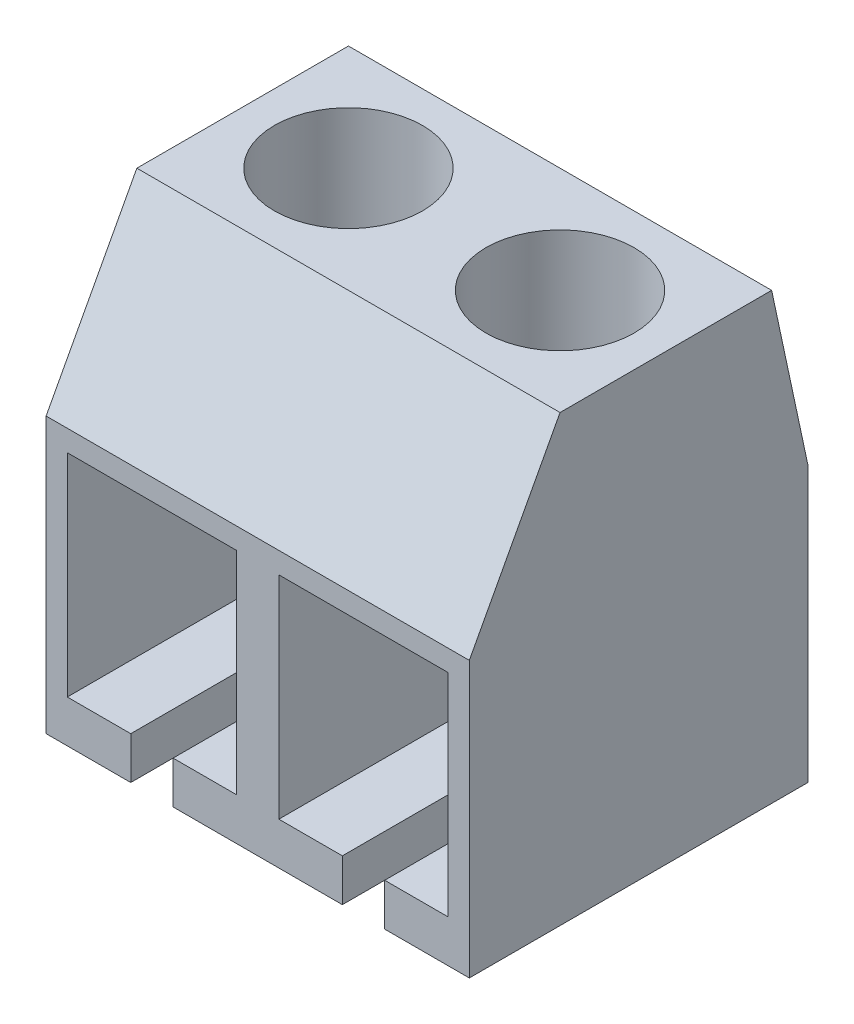
ISO-10303-21;
HEADER;
FILE_DESCRIPTION(('STEP AP214'),'2;1');
FILE_NAME('part.step','',(''),(''),'','','');
FILE_SCHEMA(('AUTOMOTIVE_DESIGN { 1 0 10303 214 1 1 1 1 }'));
ENDSEC;
DATA;
#1=APPLICATION_CONTEXT('core data for automotive mechanical design processes');
#2=APPLICATION_PROTOCOL_DEFINITION('international standard','automotive_design',2000,#1);
#3=PRODUCT_CONTEXT('',#1,'mechanical');
#4=PRODUCT('Part','Part','',(#3));
#5=PRODUCT_RELATED_PRODUCT_CATEGORY('part','',(#4));
#6=PRODUCT_DEFINITION_FORMATION('','',#4);
#7=PRODUCT_DEFINITION_CONTEXT('part definition',#1,'design');
#8=PRODUCT_DEFINITION('design','',#6,#7);
#9=PRODUCT_DEFINITION_SHAPE('','',#8);
#10=(LENGTH_UNIT() NAMED_UNIT(*) SI_UNIT(.MILLI.,.METRE.));
#11=(NAMED_UNIT(*) PLANE_ANGLE_UNIT() SI_UNIT($,.RADIAN.));
#12=(NAMED_UNIT(*) SI_UNIT($,.STERADIAN.) SOLID_ANGLE_UNIT());
#13=UNCERTAINTY_MEASURE_WITH_UNIT(LENGTH_MEASURE(1.E-05),#10,'distance_accuracy_value','');
#14=(GEOMETRIC_REPRESENTATION_CONTEXT(3) GLOBAL_UNCERTAINTY_ASSIGNED_CONTEXT((#13)) GLOBAL_UNIT_ASSIGNED_CONTEXT((#10,
#11,#12)) REPRESENTATION_CONTEXT('',''));
#15=CARTESIAN_POINT('',(0.,0.,0.));
#16=DIRECTION('',(0.,0.,1.));
#17=DIRECTION('',(1.,0.,0.));
#18=AXIS2_PLACEMENT_3D('',#15,#16,#17);
#19=CARTESIAN_POINT('',(-5.,-5.5,4.));
#20=DIRECTION('',(0.,-1.,0.));
#21=DIRECTION('',(0.,0.,-1.));
#22=AXIS2_PLACEMENT_3D('',#19,#20,#21);
#23=PLANE('',#22);
#24=DIRECTION('',(0.,0.,-1.));
#25=VECTOR('',#24,1.);
#26=CARTESIAN_POINT('',(2.,-5.49999999999999,6.));
#27=LINE('',#26,#25);
#28=CARTESIAN_POINT('',(2.,-5.49999999999999,4.));
#29=VERTEX_POINT('',#28);
#30=CARTESIAN_POINT('',(2.,-5.49999999999999,-4.));
#31=VERTEX_POINT('',#30);
#32=EDGE_CURVE('E229',#29,#31,#27,.T.);
#33=ORIENTED_EDGE('',*,*,#32,.F.);
#34=DIRECTION('',(1.,0.,0.));
#35=VECTOR('',#34,1.);
#36=CARTESIAN_POINT('',(-5.,-5.5,4.));
#37=LINE('',#36,#35);
#38=CARTESIAN_POINT('',(-2.,-5.5,4.));
#39=VERTEX_POINT('',#38);
#40=EDGE_CURVE('E314',#39,#29,#37,.T.);
#41=ORIENTED_EDGE('',*,*,#40,.F.);
#42=DIRECTION('',(0.,0.,-1.));
#43=VECTOR('',#42,1.);
#44=CARTESIAN_POINT('',(-2.,-5.49999999999999,6.));
#45=LINE('',#44,#43);
#46=CARTESIAN_POINT('',(-2.,-5.49999999999999,-4.));
#47=VERTEX_POINT('',#46);
#48=EDGE_CURVE('E59',#39,#47,#45,.T.);
#49=ORIENTED_EDGE('',*,*,#48,.T.);
#50=DIRECTION('',(1.,0.,0.));
#51=VECTOR('',#50,1.);
#52=CARTESIAN_POINT('',(-5.,-5.5,-4.));
#53=LINE('',#52,#51);
#54=EDGE_CURVE('E309',#47,#31,#53,.T.);
#55=ORIENTED_EDGE('',*,*,#54,.T.);
#56=EDGE_LOOP('',(#33,#41,#49,#55));
#57=FACE_BOUND('',#56,.T.);
#58=ADVANCED_FACE('F34',(#57),#23,.T.);
#59=DIRECTION('',(0.,0.,-1.));
#60=VECTOR('',#59,1.);
#61=CARTESIAN_POINT('',(-3.,-5.49999999999999,6.));
#62=LINE('',#61,#60);
#63=CARTESIAN_POINT('',(-3.,-5.49999999999999,4.));
#64=VERTEX_POINT('',#63);
#65=CARTESIAN_POINT('',(-3.,-5.49999999999999,-4.));
#66=VERTEX_POINT('',#65);
#67=EDGE_CURVE('E265',#64,#66,#62,.T.);
#68=ORIENTED_EDGE('',*,*,#67,.F.);
#69=CARTESIAN_POINT('',(-5.,-5.5,4.));
#70=VERTEX_POINT('',#69);
#71=EDGE_CURVE('E311',#70,#64,#37,.T.);
#72=ORIENTED_EDGE('',*,*,#71,.F.);
#73=DIRECTION('',(0.,0.,-1.));
#74=VECTOR('',#73,1.);
#75=CARTESIAN_POINT('',(-5.,-5.5,4.));
#76=LINE('',#75,#74);
#77=CARTESIAN_POINT('',(-5.,-5.5,-4.));
#78=VERTEX_POINT('',#77);
#79=EDGE_CURVE('E301',#70,#78,#76,.T.);
#80=ORIENTED_EDGE('',*,*,#79,.T.);
#81=EDGE_CURVE('E305',#78,#66,#53,.T.);
#82=ORIENTED_EDGE('',*,*,#81,.T.);
#83=EDGE_LOOP('',(#68,#72,#80,#82));
#84=FACE_BOUND('',#83,.T.);
#85=ADVANCED_FACE('F389',(#84),#23,.T.);
#86=CARTESIAN_POINT('',(-5.,1.,-4.));
#87=DIRECTION('',(0.,0.,-1.));
#88=DIRECTION('',(-1.,0.,0.));
#89=AXIS2_PLACEMENT_3D('',#86,#87,#88);
#90=PLANE('',#89);
#91=DIRECTION('',(0.,1.,0.));
#92=VECTOR('',#91,1.);
#93=CARTESIAN_POINT('',(2.,-4.5,-4.));
#94=LINE('',#93,#92);
#95=CARTESIAN_POINT('',(2.,-4.5,-4.));
#96=VERTEX_POINT('',#95);
#97=EDGE_CURVE('E208',#31,#96,#94,.T.);
#98=ORIENTED_EDGE('',*,*,#97,.F.);
#99=ORIENTED_EDGE('',*,*,#54,.F.);
#100=DIRECTION('',(0.,-1.,0.));
#101=VECTOR('',#100,1.);
#102=CARTESIAN_POINT('',(-2.,-4.5,-4.));
#103=LINE('',#102,#101);
#104=CARTESIAN_POINT('',(-2.,-4.5,-4.));
#105=VERTEX_POINT('',#104);
#106=EDGE_CURVE('E238',#105,#47,#103,.T.);
#107=ORIENTED_EDGE('',*,*,#106,.F.);
#108=DIRECTION('',(-1.,0.,0.));
#109=VECTOR('',#108,1.);
#110=CARTESIAN_POINT('',(-2.,-4.5,-4.));
#111=LINE('',#110,#109);
#112=CARTESIAN_POINT('',(-0.500000000000001,-4.5,-4.));
#113=VERTEX_POINT('',#112);
#114=EDGE_CURVE('E235',#113,#105,#111,.T.);
#115=ORIENTED_EDGE('',*,*,#114,.F.);
#116=DIRECTION('',(0.,-1.,0.));
#117=VECTOR('',#116,1.);
#118=CARTESIAN_POINT('',(-0.500000000000001,0.500000000000001,-4.));
#119=LINE('',#118,#117);
#120=CARTESIAN_POINT('',(-0.500000000000001,0.500000000000001,-4.));
#121=VERTEX_POINT('',#120);
#122=EDGE_CURVE('E252',#121,#113,#119,.T.);
#123=ORIENTED_EDGE('',*,*,#122,.F.);
#124=DIRECTION('',(1.,0.,0.));
#125=VECTOR('',#124,1.);
#126=CARTESIAN_POINT('',(-4.5,0.500000000000002,-4.));
#127=LINE('',#126,#125);
#128=CARTESIAN_POINT('',(-4.5,0.500000000000002,-4.));
#129=VERTEX_POINT('',#128);
#130=EDGE_CURVE('E249',#129,#121,#127,.T.);
#131=ORIENTED_EDGE('',*,*,#130,.F.);
#132=DIRECTION('',(0.,1.,0.));
#133=VECTOR('',#132,1.);
#134=CARTESIAN_POINT('',(-4.5,0.500000000000002,-4.));
#135=LINE('',#134,#133);
#136=CARTESIAN_POINT('',(-4.5,-4.5,-4.));
#137=VERTEX_POINT('',#136);
#138=EDGE_CURVE('E246',#137,#129,#135,.T.);
#139=ORIENTED_EDGE('',*,*,#138,.F.);
#140=DIRECTION('',(-1.,0.,0.));
#141=VECTOR('',#140,1.);
#142=CARTESIAN_POINT('',(-4.5,-4.5,-4.));
#143=LINE('',#142,#141);
#144=CARTESIAN_POINT('',(-3.,-4.5,-4.));
#145=VERTEX_POINT('',#144);
#146=EDGE_CURVE('E243',#145,#137,#143,.T.);
#147=ORIENTED_EDGE('',*,*,#146,.F.);
#148=DIRECTION('',(0.,1.,0.));
#149=VECTOR('',#148,1.);
#150=CARTESIAN_POINT('',(-3.,-4.5,-4.));
#151=LINE('',#150,#149);
#152=EDGE_CURVE('E240',#66,#145,#151,.T.);
#153=ORIENTED_EDGE('',*,*,#152,.F.);
#154=ORIENTED_EDGE('',*,*,#81,.F.);
#155=DIRECTION('',(0.,1.,0.));
#156=VECTOR('',#155,1.);
#157=CARTESIAN_POINT('',(-5.,1.,-4.));
#158=LINE('',#157,#156);
#159=CARTESIAN_POINT('',(-5.,1.,-4.));
#160=VERTEX_POINT('',#159);
#161=EDGE_CURVE('E286',#78,#160,#158,.T.);
#162=ORIENTED_EDGE('',*,*,#161,.T.);
#163=DIRECTION('',(1.,0.,0.));
#164=VECTOR('',#163,1.);
#165=CARTESIAN_POINT('',(-5.,1.,-4.));
#166=LINE('',#165,#164);
#167=CARTESIAN_POINT('',(5.,1.,-4.));
#168=VERTEX_POINT('',#167);
#169=EDGE_CURVE('E304',#160,#168,#166,.T.);
#170=ORIENTED_EDGE('',*,*,#169,.T.);
#171=DIRECTION('',(0.,1.,0.));
#172=VECTOR('',#171,1.);
#173=CARTESIAN_POINT('',(5.,1.,-4.));
#174=LINE('',#173,#172);
#175=CARTESIAN_POINT('',(5.,-5.5,-4.));
#176=VERTEX_POINT('',#175);
#177=EDGE_CURVE('E222',#176,#168,#174,.T.);
#178=ORIENTED_EDGE('',*,*,#177,.F.);
#179=CARTESIAN_POINT('',(3.,-5.49999999999999,-4.));
#180=VERTEX_POINT('',#179);
#181=EDGE_CURVE('E310',#180,#176,#53,.T.);
#182=ORIENTED_EDGE('',*,*,#181,.F.);
#183=DIRECTION('',(0.,-1.,0.));
#184=VECTOR('',#183,1.);
#185=CARTESIAN_POINT('',(3.,-4.5,-4.));
#186=LINE('',#185,#184);
#187=CARTESIAN_POINT('',(3.,-4.5,-4.));
#188=VERTEX_POINT('',#187);
#189=EDGE_CURVE('E206',#188,#180,#186,.T.);
#190=ORIENTED_EDGE('',*,*,#189,.F.);
#191=DIRECTION('',(-1.,0.,0.));
#192=VECTOR('',#191,1.);
#193=CARTESIAN_POINT('',(4.5,-4.5,-4.));
#194=LINE('',#193,#192);
#195=CARTESIAN_POINT('',(4.5,-4.5,-4.));
#196=VERTEX_POINT('',#195);
#197=EDGE_CURVE('E186',#196,#188,#194,.T.);
#198=ORIENTED_EDGE('',*,*,#197,.F.);
#199=DIRECTION('',(0.,-1.,0.));
#200=VECTOR('',#199,1.);
#201=CARTESIAN_POINT('',(4.5,0.500000000000001,-4.));
#202=LINE('',#201,#200);
#203=CARTESIAN_POINT('',(4.5,0.500000000000001,-4.));
#204=VERTEX_POINT('',#203);
#205=EDGE_CURVE('E195',#204,#196,#202,.T.);
#206=ORIENTED_EDGE('',*,*,#205,.F.);
#207=DIRECTION('',(1.,0.,0.));
#208=VECTOR('',#207,1.);
#209=CARTESIAN_POINT('',(4.5,0.500000000000001,-4.));
#210=LINE('',#209,#208);
#211=CARTESIAN_POINT('',(0.5,0.500000000000001,-4.));
#212=VERTEX_POINT('',#211);
#213=EDGE_CURVE('E192',#212,#204,#210,.T.);
#214=ORIENTED_EDGE('',*,*,#213,.F.);
#215=DIRECTION('',(0.,1.,0.));
#216=VECTOR('',#215,1.);
#217=CARTESIAN_POINT('',(0.5,0.500000000000001,-4.));
#218=LINE('',#217,#216);
#219=CARTESIAN_POINT('',(0.5,-4.5,-4.));
#220=VERTEX_POINT('',#219);
#221=EDGE_CURVE('E217',#220,#212,#218,.T.);
#222=ORIENTED_EDGE('',*,*,#221,.F.);
#223=DIRECTION('',(-1.,0.,0.));
#224=VECTOR('',#223,1.);
#225=CARTESIAN_POINT('',(2.,-4.5,-4.));
#226=LINE('',#225,#224);
#227=EDGE_CURVE('E214',#96,#220,#226,.T.);
#228=ORIENTED_EDGE('',*,*,#227,.F.);
#229=EDGE_LOOP('',(#98,#99,#107,#115,#123,#131,#139,#147,#153,#154,#162,#170,#178,#182,#190,
#198,#206,#214,#222,#228));
#230=FACE_BOUND('',#229,.T.);
#231=ADVANCED_FACE('F36',(#230),#90,.T.);
#232=DIRECTION('',(0.,0.,-1.));
#233=VECTOR('',#232,1.);
#234=CARTESIAN_POINT('',(3.,-5.49999999999999,6.));
#235=LINE('',#234,#233);
#236=CARTESIAN_POINT('',(3.,-5.49999999999999,4.));
#237=VERTEX_POINT('',#236);
#238=EDGE_CURVE('E231',#237,#180,#235,.T.);
#239=ORIENTED_EDGE('',*,*,#238,.T.);
#240=ORIENTED_EDGE('',*,*,#181,.T.);
#241=DIRECTION('',(0.,0.,-1.));
#242=VECTOR('',#241,1.);
#243=CARTESIAN_POINT('',(5.,-5.5,4.));
#244=LINE('',#243,#242);
#245=CARTESIAN_POINT('',(5.,-5.5,4.));
#246=VERTEX_POINT('',#245);
#247=EDGE_CURVE('E283',#246,#176,#244,.T.);
#248=ORIENTED_EDGE('',*,*,#247,.F.);
#249=EDGE_CURVE('E315',#237,#246,#37,.T.);
#250=ORIENTED_EDGE('',*,*,#249,.F.);
#251=EDGE_LOOP('',(#239,#240,#248,#250));
#252=FACE_BOUND('',#251,.T.);
#253=ADVANCED_FACE('F432',(#252),#23,.T.);
#254=CARTESIAN_POINT('',(-5.,1.,4.));
#255=DIRECTION('',(0.,0.,1.));
#256=DIRECTION('',(0.,-1.,0.));
#257=AXIS2_PLACEMENT_3D('',#254,#255,#256);
#258=PLANE('',#257);
#259=DIRECTION('',(0.,-1.,0.));
#260=VECTOR('',#259,1.);
#261=CARTESIAN_POINT('',(2.00000000000001,0.99999999999999,4.));
#262=LINE('',#261,#260);
#263=CARTESIAN_POINT('',(2.,-4.5,4.));
#264=VERTEX_POINT('',#263);
#265=EDGE_CURVE('E11',#264,#29,#262,.T.);
#266=ORIENTED_EDGE('',*,*,#265,.F.);
#267=DIRECTION('',(1.,0.,0.));
#268=VECTOR('',#267,1.);
#269=CARTESIAN_POINT('',(-5.,-4.5,4.));
#270=LINE('',#269,#268);
#271=CARTESIAN_POINT('',(0.5,-4.5,4.));
#272=VERTEX_POINT('',#271);
#273=EDGE_CURVE('E43',#272,#264,#270,.T.);
#274=ORIENTED_EDGE('',*,*,#273,.F.);
#275=DIRECTION('',(0.,-1.,0.));
#276=VECTOR('',#275,1.);
#277=CARTESIAN_POINT('',(0.5,1.,4.));
#278=LINE('',#277,#276);
#279=CARTESIAN_POINT('',(0.5,0.500000000000001,4.));
#280=VERTEX_POINT('',#279);
#281=EDGE_CURVE('E343',#280,#272,#278,.T.);
#282=ORIENTED_EDGE('',*,*,#281,.F.);
#283=DIRECTION('',(-1.,0.,0.));
#284=VECTOR('',#283,1.);
#285=CARTESIAN_POINT('',(-5.,0.500000000000001,4.));
#286=LINE('',#285,#284);
#287=CARTESIAN_POINT('',(4.5,0.500000000000001,4.));
#288=VERTEX_POINT('',#287);
#289=EDGE_CURVE('E341',#288,#280,#286,.T.);
#290=ORIENTED_EDGE('',*,*,#289,.F.);
#291=DIRECTION('',(0.,1.,0.));
#292=VECTOR('',#291,1.);
#293=CARTESIAN_POINT('',(4.5,1.,4.));
#294=LINE('',#293,#292);
#295=CARTESIAN_POINT('',(4.5,-4.5,4.));
#296=VERTEX_POINT('',#295);
#297=EDGE_CURVE('E339',#296,#288,#294,.T.);
#298=ORIENTED_EDGE('',*,*,#297,.F.);
#299=DIRECTION('',(1.,0.,0.));
#300=VECTOR('',#299,1.);
#301=CARTESIAN_POINT('',(-5.,-4.49999999999999,4.));
#302=LINE('',#301,#300);
#303=CARTESIAN_POINT('',(3.,-4.5,4.));
#304=VERTEX_POINT('',#303);
#305=EDGE_CURVE('E189',#304,#296,#302,.T.);
#306=ORIENTED_EDGE('',*,*,#305,.F.);
#307=DIRECTION('',(0.,1.,0.));
#308=VECTOR('',#307,1.);
#309=CARTESIAN_POINT('',(2.99999999999999,1.00000000000001,4.));
#310=LINE('',#309,#308);
#311=EDGE_CURVE('E337',#237,#304,#310,.T.);
#312=ORIENTED_EDGE('',*,*,#311,.F.);
#313=ORIENTED_EDGE('',*,*,#249,.T.);
#314=DIRECTION('',(0.,-1.,0.));
#315=VECTOR('',#314,1.);
#316=CARTESIAN_POINT('',(5.,1.,4.));
#317=LINE('',#316,#315);
#318=CARTESIAN_POINT('',(5.,1.,4.));
#319=VERTEX_POINT('',#318);
#320=EDGE_CURVE('E280',#319,#246,#317,.T.);
#321=ORIENTED_EDGE('',*,*,#320,.F.);
#322=DIRECTION('',(1.,0.,0.));
#323=VECTOR('',#322,1.);
#324=CARTESIAN_POINT('',(-5.,1.,4.));
#325=LINE('',#324,#323);
#326=CARTESIAN_POINT('',(-5.,1.,4.));
#327=VERTEX_POINT('',#326);
#328=EDGE_CURVE('E316',#327,#319,#325,.T.);
#329=ORIENTED_EDGE('',*,*,#328,.F.);
#330=DIRECTION('',(0.,-1.,0.));
#331=VECTOR('',#330,1.);
#332=CARTESIAN_POINT('',(-5.,1.,4.));
#333=LINE('',#332,#331);
#334=EDGE_CURVE('E298',#327,#70,#333,.T.);
#335=ORIENTED_EDGE('',*,*,#334,.T.);
#336=ORIENTED_EDGE('',*,*,#71,.T.);
#337=DIRECTION('',(0.,-1.,0.));
#338=VECTOR('',#337,1.);
#339=CARTESIAN_POINT('',(-3.,1.,4.));
#340=LINE('',#339,#338);
#341=CARTESIAN_POINT('',(-3.,-4.5,4.));
#342=VERTEX_POINT('',#341);
#343=EDGE_CURVE('E334',#342,#64,#340,.T.);
#344=ORIENTED_EDGE('',*,*,#343,.F.);
#345=DIRECTION('',(1.,0.,0.));
#346=VECTOR('',#345,1.);
#347=CARTESIAN_POINT('',(-5.,-4.5,4.));
#348=LINE('',#347,#346);
#349=CARTESIAN_POINT('',(-4.5,-4.5,4.));
#350=VERTEX_POINT('',#349);
#351=EDGE_CURVE('E332',#350,#342,#348,.T.);
#352=ORIENTED_EDGE('',*,*,#351,.F.);
#353=DIRECTION('',(0.,-1.,0.));
#354=VECTOR('',#353,1.);
#355=CARTESIAN_POINT('',(-4.5,1.,4.));
#356=LINE('',#355,#354);
#357=CARTESIAN_POINT('',(-4.5,0.500000000000002,4.));
#358=VERTEX_POINT('',#357);
#359=EDGE_CURVE('E330',#358,#350,#356,.T.);
#360=ORIENTED_EDGE('',*,*,#359,.F.);
#361=DIRECTION('',(-1.,0.,0.));
#362=VECTOR('',#361,1.);
#363=CARTESIAN_POINT('',(-5.,0.500000000000002,4.));
#364=LINE('',#363,#362);
#365=CARTESIAN_POINT('',(-0.500000000000001,0.500000000000001,4.));
#366=VERTEX_POINT('',#365);
#367=EDGE_CURVE('E328',#366,#358,#364,.T.);
#368=ORIENTED_EDGE('',*,*,#367,.F.);
#369=DIRECTION('',(0.,1.,0.));
#370=VECTOR('',#369,1.);
#371=CARTESIAN_POINT('',(-0.5,1.,4.));
#372=LINE('',#371,#370);
#373=CARTESIAN_POINT('',(-0.500000000000001,-4.5,4.));
#374=VERTEX_POINT('',#373);
#375=EDGE_CURVE('E326',#374,#366,#372,.T.);
#376=ORIENTED_EDGE('',*,*,#375,.F.);
#377=DIRECTION('',(1.,0.,0.));
#378=VECTOR('',#377,1.);
#379=CARTESIAN_POINT('',(-5.,-4.5,4.));
#380=LINE('',#379,#378);
#381=CARTESIAN_POINT('',(-2.,-4.5,4.));
#382=VERTEX_POINT('',#381);
#383=EDGE_CURVE('E324',#382,#374,#380,.T.);
#384=ORIENTED_EDGE('',*,*,#383,.F.);
#385=DIRECTION('',(0.,1.,0.));
#386=VECTOR('',#385,1.);
#387=CARTESIAN_POINT('',(-2.00000000000002,1.00000000000001,4.));
#388=LINE('',#387,#386);
#389=EDGE_CURVE('E308',#39,#382,#388,.T.);
#390=ORIENTED_EDGE('',*,*,#389,.F.);
#391=ORIENTED_EDGE('',*,*,#40,.T.);
#392=EDGE_LOOP('',(#266,#274,#282,#290,#298,#306,#312,#313,#321,#329,#335,#336,#344,#352,#360,
#368,#376,#384,#390,#391));
#393=FACE_BOUND('',#392,.T.);
#394=ADVANCED_FACE('F381',(#393),#258,.T.);
#395=CARTESIAN_POINT('',(-5.,1.,4.));
#396=DIRECTION('',(0.,0.472385008762964,0.881392309641975));
#397=DIRECTION('',(0.,-0.881392309641975,0.472385008762964));
#398=AXIS2_PLACEMENT_3D('',#395,#396,#397);
#399=PLANE('',#398);
#400=ORIENTED_EDGE('',*,*,#328,.T.);
#401=DIRECTION('',(0.,-0.881392309641975,0.472385008762964));
#402=VECTOR('',#401,1.);
#403=CARTESIAN_POINT('',(5.,1.,4.));
#404=LINE('',#403,#402);
#405=CARTESIAN_POINT('',(5.,5.,1.8561872909699));
#406=VERTEX_POINT('',#405);
#407=EDGE_CURVE('E277',#406,#319,#404,.T.);
#408=ORIENTED_EDGE('',*,*,#407,.F.);
#409=DIRECTION('',(1.,0.,0.));
#410=VECTOR('',#409,1.);
#411=CARTESIAN_POINT('',(-5.,5.,1.8561872909699));
#412=LINE('',#411,#410);
#413=CARTESIAN_POINT('',(-5.,5.,1.8561872909699));
#414=VERTEX_POINT('',#413);
#415=EDGE_CURVE('E318',#414,#406,#412,.T.);
#416=ORIENTED_EDGE('',*,*,#415,.F.);
#417=DIRECTION('',(0.,-0.881392309641975,0.472385008762964));
#418=VECTOR('',#417,1.);
#419=CARTESIAN_POINT('',(-5.,1.,4.));
#420=LINE('',#419,#418);
#421=EDGE_CURVE('E295',#414,#327,#420,.T.);
#422=ORIENTED_EDGE('',*,*,#421,.T.);
#423=EDGE_LOOP('',(#400,#408,#416,#422));
#424=FACE_BOUND('',#423,.T.);
#425=ADVANCED_FACE('F366',(#424),#399,.T.);
#426=CARTESIAN_POINT('',(-5.,5.,1.8561872909699));
#427=DIRECTION('',(0.,1.,0.));
#428=DIRECTION('',(0.,0.,1.));
#429=AXIS2_PLACEMENT_3D('',#426,#427,#428);
#430=PLANE('',#429);
#431=CARTESIAN_POINT('',(-2.5,5.,-0.643812709030097));
#432=DIRECTION('',(0.,1.,0.));
#433=DIRECTION('',(0.,0.,1.));
#434=AXIS2_PLACEMENT_3D('',#431,#432,#433);
#435=CIRCLE('',#434,1.75);
#436=CARTESIAN_POINT('',(-2.5,5.,1.1061872909699));
#437=VERTEX_POINT('',#436);
#438=EDGE_CURVE('E347',#437,#437,#435,.T.);
#439=ORIENTED_EDGE('',*,*,#438,.F.);
#440=EDGE_LOOP('',(#439));
#441=FACE_BOUND('',#440,.T.);
#442=CARTESIAN_POINT('',(2.5,5.,-0.643812709030097));
#443=DIRECTION('',(0.,1.,0.));
#444=DIRECTION('',(0.,0.,1.));
#445=AXIS2_PLACEMENT_3D('',#442,#443,#444);
#446=CIRCLE('',#445,1.75);
#447=CARTESIAN_POINT('',(2.5,5.,1.1061872909699));
#448=VERTEX_POINT('',#447);
#449=EDGE_CURVE('E352',#448,#448,#446,.T.);
#450=ORIENTED_EDGE('',*,*,#449,.F.);
#451=EDGE_LOOP('',(#450));
#452=FACE_BOUND('',#451,.T.);
#453=ORIENTED_EDGE('',*,*,#415,.T.);
#454=DIRECTION('',(0.,0.,1.));
#455=VECTOR('',#454,1.);
#456=CARTESIAN_POINT('',(5.,5.,1.8561872909699));
#457=LINE('',#456,#455);
#458=CARTESIAN_POINT('',(5.,5.,-3.1438127090301));
#459=VERTEX_POINT('',#458);
#460=EDGE_CURVE('E274',#459,#406,#457,.T.);
#461=ORIENTED_EDGE('',*,*,#460,.F.);
#462=DIRECTION('',(1.,0.,0.));
#463=VECTOR('',#462,1.);
#464=CARTESIAN_POINT('',(-5.,5.,-3.1438127090301));
#465=LINE('',#464,#463);
#466=CARTESIAN_POINT('',(-5.,5.,-3.1438127090301));
#467=VERTEX_POINT('',#466);
#468=EDGE_CURVE('E320',#467,#459,#465,.T.);
#469=ORIENTED_EDGE('',*,*,#468,.F.);
#470=DIRECTION('',(0.,0.,1.));
#471=VECTOR('',#470,1.);
#472=CARTESIAN_POINT('',(-5.,5.,1.8561872909699));
#473=LINE('',#472,#471);
#474=EDGE_CURVE('E292',#467,#414,#473,.T.);
#475=ORIENTED_EDGE('',*,*,#474,.T.);
#476=EDGE_LOOP('',(#453,#461,#469,#475));
#477=FACE_BOUND('',#476,.T.);
#478=ADVANCED_FACE('F362',(#441,#452,#477),#430,.T.);
#479=CARTESIAN_POINT('',(-5.,1.,-4.));
#480=DIRECTION('',(0.,0.209305738726685,-0.977850248113727));
#481=DIRECTION('',(0.,0.977850248113727,0.209305738726685));
#482=AXIS2_PLACEMENT_3D('',#479,#480,#481);
#483=PLANE('',#482);
#484=ORIENTED_EDGE('',*,*,#468,.T.);
#485=DIRECTION('',(0.,0.977850248113727,0.209305738726685));
#486=VECTOR('',#485,1.);
#487=CARTESIAN_POINT('',(5.,1.,-4.));
#488=LINE('',#487,#486);
#489=EDGE_CURVE('E271',#168,#459,#488,.T.);
#490=ORIENTED_EDGE('',*,*,#489,.F.);
#491=ORIENTED_EDGE('',*,*,#169,.F.);
#492=DIRECTION('',(0.,0.977850248113727,0.209305738726685));
#493=VECTOR('',#492,1.);
#494=CARTESIAN_POINT('',(-5.,1.,-4.));
#495=LINE('',#494,#493);
#496=EDGE_CURVE('E289',#160,#467,#495,.T.);
#497=ORIENTED_EDGE('',*,*,#496,.T.);
#498=EDGE_LOOP('',(#484,#490,#491,#497));
#499=FACE_BOUND('',#498,.T.);
#500=ADVANCED_FACE('F365',(#499),#483,.T.);
#501=CARTESIAN_POINT('',(-5.,0.,0.));
#502=DIRECTION('',(1.,0.,0.));
#503=DIRECTION('',(0.,0.,-1.));
#504=AXIS2_PLACEMENT_3D('',#501,#502,#503);
#505=PLANE('',#504);
#506=ORIENTED_EDGE('',*,*,#161,.F.);
#507=ORIENTED_EDGE('',*,*,#79,.F.);
#508=ORIENTED_EDGE('',*,*,#334,.F.);
#509=ORIENTED_EDGE('',*,*,#421,.F.);
#510=ORIENTED_EDGE('',*,*,#474,.F.);
#511=ORIENTED_EDGE('',*,*,#496,.F.);
#512=EDGE_LOOP('',(#506,#507,#508,#509,#510,#511));
#513=FACE_BOUND('',#512,.T.);
#514=ADVANCED_FACE('F385',(#513),#505,.F.);
#515=CARTESIAN_POINT('',(5.,0.,0.));
#516=DIRECTION('',(1.,0.,0.));
#517=DIRECTION('',(0.,0.,-1.));
#518=AXIS2_PLACEMENT_3D('',#515,#516,#517);
#519=PLANE('',#518);
#520=ORIENTED_EDGE('',*,*,#177,.T.);
#521=ORIENTED_EDGE('',*,*,#489,.T.);
#522=ORIENTED_EDGE('',*,*,#460,.T.);
#523=ORIENTED_EDGE('',*,*,#407,.T.);
#524=ORIENTED_EDGE('',*,*,#320,.T.);
#525=ORIENTED_EDGE('',*,*,#247,.T.);
#526=EDGE_LOOP('',(#520,#521,#522,#523,#524,#525));
#527=FACE_BOUND('',#526,.T.);
#528=ADVANCED_FACE('F375',(#527),#519,.T.);
#529=CARTESIAN_POINT('',(-2.,-4.5,6.));
#530=DIRECTION('',(0.,-1.,0.));
#531=DIRECTION('',(1.,0.,0.));
#532=AXIS2_PLACEMENT_3D('',#529,#530,#531);
#533=PLANE('',#532);
#534=ORIENTED_EDGE('',*,*,#383,.T.);
#535=DIRECTION('',(0.,0.,-1.));
#536=VECTOR('',#535,1.);
#537=CARTESIAN_POINT('',(-0.500000000000001,-4.5,6.));
#538=LINE('',#537,#536);
#539=EDGE_CURVE('E202',#374,#113,#538,.T.);
#540=ORIENTED_EDGE('',*,*,#539,.T.);
#541=ORIENTED_EDGE('',*,*,#114,.T.);
#542=DIRECTION('',(0.,0.,-1.));
#543=VECTOR('',#542,1.);
#544=CARTESIAN_POINT('',(-2.,-4.5,6.));
#545=LINE('',#544,#543);
#546=EDGE_CURVE('E255',#382,#105,#545,.T.);
#547=ORIENTED_EDGE('',*,*,#546,.F.);
#548=EDGE_LOOP('',(#534,#540,#541,#547));
#549=FACE_BOUND('',#548,.T.);
#550=ADVANCED_FACE('F418',(#549),#533,.F.);
#551=CARTESIAN_POINT('',(-0.500000000000001,0.500000000000001,6.));
#552=DIRECTION('',(1.,0.,0.));
#553=DIRECTION('',(0.,1.,0.));
#554=AXIS2_PLACEMENT_3D('',#551,#552,#553);
#555=PLANE('',#554);
#556=ORIENTED_EDGE('',*,*,#375,.T.);
#557=DIRECTION('',(0.,0.,-1.));
#558=VECTOR('',#557,1.);
#559=CARTESIAN_POINT('',(-0.500000000000001,0.500000000000001,6.));
#560=LINE('',#559,#558);
#561=EDGE_CURVE('E257',#366,#121,#560,.T.);
#562=ORIENTED_EDGE('',*,*,#561,.T.);
#563=ORIENTED_EDGE('',*,*,#122,.T.);
#564=ORIENTED_EDGE('',*,*,#539,.F.);
#565=EDGE_LOOP('',(#556,#562,#563,#564));
#566=FACE_BOUND('',#565,.T.);
#567=ADVANCED_FACE('F414',(#566),#555,.F.);
#568=CARTESIAN_POINT('',(-4.5,0.500000000000002,6.));
#569=DIRECTION('',(0.,1.,0.));
#570=DIRECTION('',(-1.,0.,0.));
#571=AXIS2_PLACEMENT_3D('',#568,#569,#570);
#572=PLANE('',#571);
#573=CARTESIAN_POINT('',(-2.5,0.500000000000001,-0.643812709030097));
#574=DIRECTION('',(0.,1.,0.));
#575=DIRECTION('',(-1.,0.,0.));
#576=AXIS2_PLACEMENT_3D('',#573,#574,#575);
#577=CIRCLE('',#576,1.75);
#578=CARTESIAN_POINT('',(-4.25,0.500000000000002,-0.643812709030097));
#579=VERTEX_POINT('',#578);
#580=EDGE_CURVE('E38',#579,#579,#577,.T.);
#581=ORIENTED_EDGE('',*,*,#580,.T.);
#582=EDGE_LOOP('',(#581));
#583=FACE_BOUND('',#582,.T.);
#584=ORIENTED_EDGE('',*,*,#367,.T.);
#585=DIRECTION('',(0.,0.,-1.));
#586=VECTOR('',#585,1.);
#587=CARTESIAN_POINT('',(-4.5,0.500000000000002,6.));
#588=LINE('',#587,#586);
#589=EDGE_CURVE('E259',#358,#129,#588,.T.);
#590=ORIENTED_EDGE('',*,*,#589,.T.);
#591=ORIENTED_EDGE('',*,*,#130,.T.);
#592=ORIENTED_EDGE('',*,*,#561,.F.);
#593=EDGE_LOOP('',(#584,#590,#591,#592));
#594=FACE_BOUND('',#593,.T.);
#595=ADVANCED_FACE('F411',(#583,#594),#572,.F.);
#596=CARTESIAN_POINT('',(-4.5,0.500000000000002,6.));
#597=DIRECTION('',(-1.,0.,0.));
#598=DIRECTION('',(0.,-1.,0.));
#599=AXIS2_PLACEMENT_3D('',#596,#597,#598);
#600=PLANE('',#599);
#601=ORIENTED_EDGE('',*,*,#359,.T.);
#602=DIRECTION('',(0.,0.,-1.));
#603=VECTOR('',#602,1.);
#604=CARTESIAN_POINT('',(-4.5,-4.5,6.));
#605=LINE('',#604,#603);
#606=EDGE_CURVE('E261',#350,#137,#605,.T.);
#607=ORIENTED_EDGE('',*,*,#606,.T.);
#608=ORIENTED_EDGE('',*,*,#138,.T.);
#609=ORIENTED_EDGE('',*,*,#589,.F.);
#610=EDGE_LOOP('',(#601,#607,#608,#609));
#611=FACE_BOUND('',#610,.T.);
#612=ADVANCED_FACE('F403',(#611),#600,.F.);
#613=CARTESIAN_POINT('',(-4.5,-4.5,6.));
#614=DIRECTION('',(0.,-1.,0.));
#615=DIRECTION('',(1.,0.,0.));
#616=AXIS2_PLACEMENT_3D('',#613,#614,#615);
#617=PLANE('',#616);
#618=ORIENTED_EDGE('',*,*,#351,.T.);
#619=DIRECTION('',(0.,0.,-1.));
#620=VECTOR('',#619,1.);
#621=CARTESIAN_POINT('',(-3.,-4.5,6.));
#622=LINE('',#621,#620);
#623=EDGE_CURVE('E263',#342,#145,#622,.T.);
#624=ORIENTED_EDGE('',*,*,#623,.T.);
#625=ORIENTED_EDGE('',*,*,#146,.T.);
#626=ORIENTED_EDGE('',*,*,#606,.F.);
#627=EDGE_LOOP('',(#618,#624,#625,#626));
#628=FACE_BOUND('',#627,.T.);
#629=ADVANCED_FACE('F399',(#628),#617,.F.);
#630=CARTESIAN_POINT('',(-3.,-4.5,6.));
#631=DIRECTION('',(-1.,0.,0.));
#632=DIRECTION('',(0.,-1.,0.));
#633=AXIS2_PLACEMENT_3D('',#630,#631,#632);
#634=PLANE('',#633);
#635=ORIENTED_EDGE('',*,*,#343,.T.);
#636=ORIENTED_EDGE('',*,*,#67,.T.);
#637=ORIENTED_EDGE('',*,*,#152,.T.);
#638=ORIENTED_EDGE('',*,*,#623,.F.);
#639=EDGE_LOOP('',(#635,#636,#637,#638));
#640=FACE_BOUND('',#639,.T.);
#641=ADVANCED_FACE('F395',(#640),#634,.F.);
#642=CARTESIAN_POINT('',(-2.,-4.5,6.));
#643=DIRECTION('',(1.,0.,0.));
#644=DIRECTION('',(0.,1.,0.));
#645=AXIS2_PLACEMENT_3D('',#642,#643,#644);
#646=PLANE('',#645);
#647=ORIENTED_EDGE('',*,*,#389,.T.);
#648=ORIENTED_EDGE('',*,*,#546,.T.);
#649=ORIENTED_EDGE('',*,*,#106,.T.);
#650=ORIENTED_EDGE('',*,*,#48,.F.);
#651=EDGE_LOOP('',(#647,#648,#649,#650));
#652=FACE_BOUND('',#651,.T.);
#653=ADVANCED_FACE('F456',(#652),#646,.F.);
#654=CARTESIAN_POINT('',(4.5,0.500000000000001,6.));
#655=DIRECTION('',(1.,0.,0.));
#656=DIRECTION('',(0.,1.,0.));
#657=AXIS2_PLACEMENT_3D('',#654,#655,#656);
#658=PLANE('',#657);
#659=ORIENTED_EDGE('',*,*,#297,.T.);
#660=DIRECTION('',(0.,0.,-1.));
#661=VECTOR('',#660,1.);
#662=CARTESIAN_POINT('',(4.5,0.500000000000001,6.));
#663=LINE('',#662,#661);
#664=EDGE_CURVE('E198',#288,#204,#663,.T.);
#665=ORIENTED_EDGE('',*,*,#664,.T.);
#666=ORIENTED_EDGE('',*,*,#205,.T.);
#667=DIRECTION('',(0.,0.,-1.));
#668=VECTOR('',#667,1.);
#669=CARTESIAN_POINT('',(4.5,-4.5,6.));
#670=LINE('',#669,#668);
#671=EDGE_CURVE('E182',#296,#196,#670,.T.);
#672=ORIENTED_EDGE('',*,*,#671,.F.);
#673=EDGE_LOOP('',(#659,#665,#666,#672));
#674=FACE_BOUND('',#673,.T.);
#675=ADVANCED_FACE('F196',(#674),#658,.F.);
#676=CARTESIAN_POINT('',(4.5,0.500000000000001,6.));
#677=DIRECTION('',(0.,1.,0.));
#678=DIRECTION('',(0.,0.,1.));
#679=AXIS2_PLACEMENT_3D('',#676,#677,#678);
#680=PLANE('',#679);
#681=CARTESIAN_POINT('',(2.5,0.500000000000001,-0.643812709030097));
#682=DIRECTION('',(0.,1.,0.));
#683=DIRECTION('',(0.,0.,1.));
#684=AXIS2_PLACEMENT_3D('',#681,#682,#683);
#685=CIRCLE('',#684,1.75);
#686=CARTESIAN_POINT('',(2.5,0.500000000000001,1.1061872909699));
#687=VERTEX_POINT('',#686);
#688=EDGE_CURVE('E345',#687,#687,#685,.T.);
#689=ORIENTED_EDGE('',*,*,#688,.T.);
#690=EDGE_LOOP('',(#689));
#691=FACE_BOUND('',#690,.T.);
#692=ORIENTED_EDGE('',*,*,#289,.T.);
#693=DIRECTION('',(0.,0.,-1.));
#694=VECTOR('',#693,1.);
#695=CARTESIAN_POINT('',(0.5,0.500000000000001,6.));
#696=LINE('',#695,#694);
#697=EDGE_CURVE('E223',#280,#212,#696,.T.);
#698=ORIENTED_EDGE('',*,*,#697,.T.);
#699=ORIENTED_EDGE('',*,*,#213,.T.);
#700=ORIENTED_EDGE('',*,*,#664,.F.);
#701=EDGE_LOOP('',(#692,#698,#699,#700));
#702=FACE_BOUND('',#701,.T.);
#703=ADVANCED_FACE('F448',(#691,#702),#680,.F.);
#704=CARTESIAN_POINT('',(0.5,0.500000000000001,6.));
#705=DIRECTION('',(-1.,0.,0.));
#706=DIRECTION('',(0.,-1.,0.));
#707=AXIS2_PLACEMENT_3D('',#704,#705,#706);
#708=PLANE('',#707);
#709=ORIENTED_EDGE('',*,*,#281,.T.);
#710=DIRECTION('',(0.,0.,-1.));
#711=VECTOR('',#710,1.);
#712=CARTESIAN_POINT('',(0.5,-4.5,6.));
#713=LINE('',#712,#711);
#714=EDGE_CURVE('E225',#272,#220,#713,.T.);
#715=ORIENTED_EDGE('',*,*,#714,.T.);
#716=ORIENTED_EDGE('',*,*,#221,.T.);
#717=ORIENTED_EDGE('',*,*,#697,.F.);
#718=EDGE_LOOP('',(#709,#715,#716,#717));
#719=FACE_BOUND('',#718,.T.);
#720=ADVANCED_FACE('F445',(#719),#708,.F.);
#721=CARTESIAN_POINT('',(2.,-4.5,6.));
#722=DIRECTION('',(0.,-1.,0.));
#723=DIRECTION('',(1.,0.,0.));
#724=AXIS2_PLACEMENT_3D('',#721,#722,#723);
#725=PLANE('',#724);
#726=ORIENTED_EDGE('',*,*,#273,.T.);
#727=DIRECTION('',(0.,0.,-1.));
#728=VECTOR('',#727,1.);
#729=CARTESIAN_POINT('',(2.,-4.5,6.));
#730=LINE('',#729,#728);
#731=EDGE_CURVE('E227',#264,#96,#730,.T.);
#732=ORIENTED_EDGE('',*,*,#731,.T.);
#733=ORIENTED_EDGE('',*,*,#227,.T.);
#734=ORIENTED_EDGE('',*,*,#714,.F.);
#735=EDGE_LOOP('',(#726,#732,#733,#734));
#736=FACE_BOUND('',#735,.T.);
#737=ADVANCED_FACE('F443',(#736),#725,.F.);
#738=CARTESIAN_POINT('',(2.,-4.5,6.));
#739=DIRECTION('',(-1.,0.,0.));
#740=DIRECTION('',(0.,-1.,0.));
#741=AXIS2_PLACEMENT_3D('',#738,#739,#740);
#742=PLANE('',#741);
#743=ORIENTED_EDGE('',*,*,#265,.T.);
#744=ORIENTED_EDGE('',*,*,#32,.T.);
#745=ORIENTED_EDGE('',*,*,#97,.T.);
#746=ORIENTED_EDGE('',*,*,#731,.F.);
#747=EDGE_LOOP('',(#743,#744,#745,#746));
#748=FACE_BOUND('',#747,.T.);
#749=ADVANCED_FACE('F437',(#748),#742,.F.);
#750=CARTESIAN_POINT('',(3.,-4.5,6.));
#751=DIRECTION('',(1.,0.,0.));
#752=DIRECTION('',(0.,1.,0.));
#753=AXIS2_PLACEMENT_3D('',#750,#751,#752);
#754=PLANE('',#753);
#755=ORIENTED_EDGE('',*,*,#311,.T.);
#756=DIRECTION('',(0.,0.,-1.));
#757=VECTOR('',#756,1.);
#758=CARTESIAN_POINT('',(3.,-4.5,6.));
#759=LINE('',#758,#757);
#760=EDGE_CURVE('E51',#304,#188,#759,.T.);
#761=ORIENTED_EDGE('',*,*,#760,.T.);
#762=ORIENTED_EDGE('',*,*,#189,.T.);
#763=ORIENTED_EDGE('',*,*,#238,.F.);
#764=EDGE_LOOP('',(#755,#761,#762,#763));
#765=FACE_BOUND('',#764,.T.);
#766=ADVANCED_FACE('F571',(#765),#754,.F.);
#767=CARTESIAN_POINT('',(4.5,-4.5,6.));
#768=DIRECTION('',(0.,-1.,0.));
#769=DIRECTION('',(1.,0.,0.));
#770=AXIS2_PLACEMENT_3D('',#767,#768,#769);
#771=PLANE('',#770);
#772=ORIENTED_EDGE('',*,*,#305,.T.);
#773=ORIENTED_EDGE('',*,*,#671,.T.);
#774=ORIENTED_EDGE('',*,*,#197,.T.);
#775=ORIENTED_EDGE('',*,*,#760,.F.);
#776=EDGE_LOOP('',(#772,#773,#774,#775));
#777=FACE_BOUND('',#776,.T.);
#778=ADVANCED_FACE('F184',(#777),#771,.F.);
#779=CARTESIAN_POINT('',(2.5,-2.,-0.643812709030097));
#780=DIRECTION('',(0.,1.,0.));
#781=DIRECTION('',(0.,0.,1.));
#782=AXIS2_PLACEMENT_3D('',#779,#780,#781);
#783=CYLINDRICAL_SURFACE('',#782,1.75);
#784=ORIENTED_EDGE('',*,*,#449,.T.);
#785=EDGE_LOOP('',(#784));
#786=FACE_BOUND('',#785,.T.);
#787=ORIENTED_EDGE('',*,*,#688,.F.);
#788=EDGE_LOOP('',(#787));
#789=FACE_BOUND('',#788,.T.);
#790=ADVANCED_FACE('F359',(#786,#789),#783,.F.);
#791=CARTESIAN_POINT('',(-2.5,-2.,-0.643812709030097));
#792=DIRECTION('',(0.,1.,0.));
#793=DIRECTION('',(0.,0.,1.));
#794=AXIS2_PLACEMENT_3D('',#791,#792,#793);
#795=CYLINDRICAL_SURFACE('',#794,1.75);
#796=ORIENTED_EDGE('',*,*,#438,.T.);
#797=EDGE_LOOP('',(#796));
#798=FACE_BOUND('',#797,.T.);
#799=ORIENTED_EDGE('',*,*,#580,.F.);
#800=EDGE_LOOP('',(#799));
#801=FACE_BOUND('',#800,.T.);
#802=ADVANCED_FACE('F556',(#798,#801),#795,.F.);
#803=CLOSED_SHELL('',(#58,#85,#231,#253,#394,#425,#478,#500,#514,#528,#550,#567,#595,#612,#629,
#641,#653,#675,#703,#720,#737,#749,#766,#778,#790,#802));
#804=MANIFOLD_SOLID_BREP('B2',#803);
#805=ADVANCED_BREP_SHAPE_REPRESENTATION('',(#18,#804),#14);
#806=SHAPE_DEFINITION_REPRESENTATION(#9,#805);
ENDSEC;
END-ISO-10303-21;
